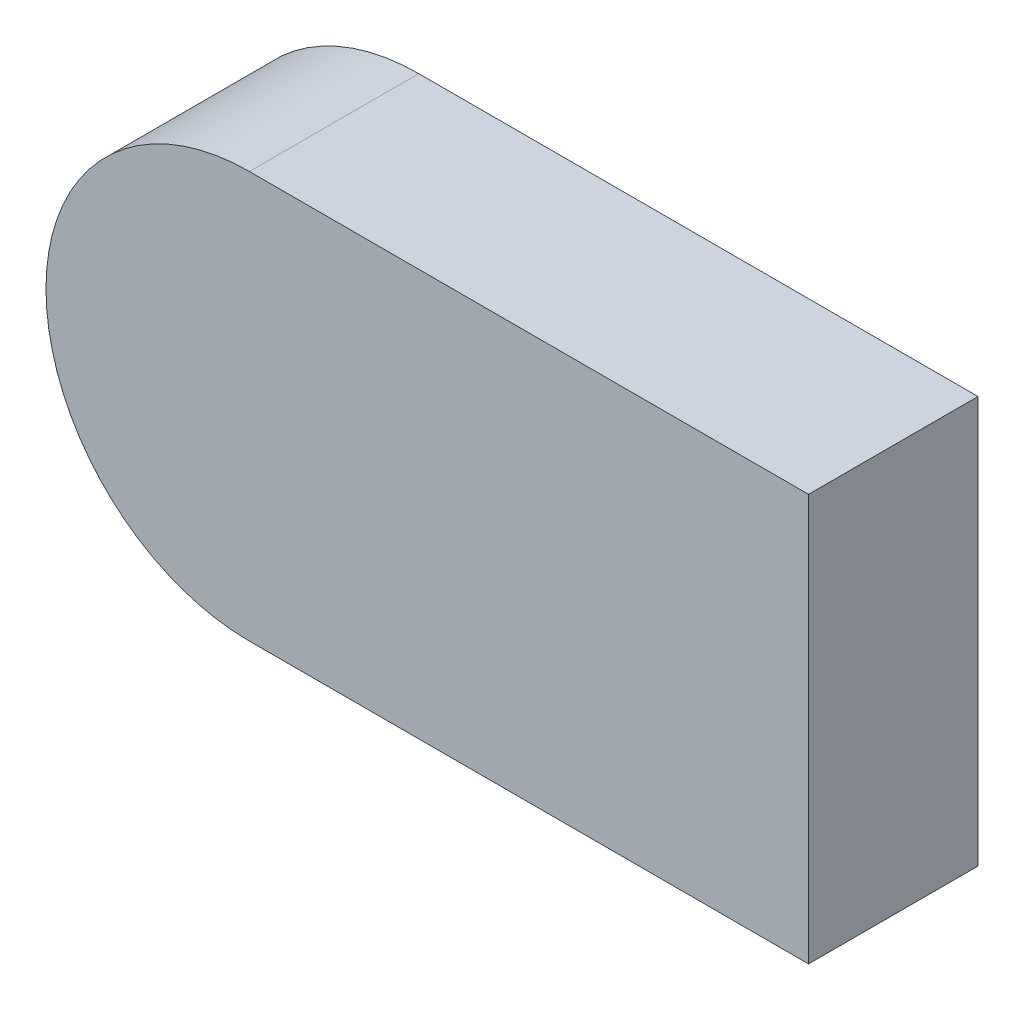
ISO-10303-21;
HEADER;
FILE_DESCRIPTION(('STEP AP214'),'2;1');
FILE_NAME('part.step','',(''),(''),'','','');
FILE_SCHEMA(('AUTOMOTIVE_DESIGN { 1 0 10303 214 1 1 1 1 }'));
ENDSEC;
DATA;
#1=APPLICATION_CONTEXT('core data for automotive mechanical design processes');
#2=APPLICATION_PROTOCOL_DEFINITION('international standard','automotive_design',2000,#1);
#3=PRODUCT_CONTEXT('',#1,'mechanical');
#4=PRODUCT('Part','Part','',(#3));
#5=PRODUCT_RELATED_PRODUCT_CATEGORY('part','',(#4));
#6=PRODUCT_DEFINITION_FORMATION('','',#4);
#7=PRODUCT_DEFINITION_CONTEXT('part definition',#1,'design');
#8=PRODUCT_DEFINITION('design','',#6,#7);
#9=PRODUCT_DEFINITION_SHAPE('','',#8);
#10=(LENGTH_UNIT() NAMED_UNIT(*) SI_UNIT(.MILLI.,.METRE.));
#11=(NAMED_UNIT(*) PLANE_ANGLE_UNIT() SI_UNIT($,.RADIAN.));
#12=(NAMED_UNIT(*) SI_UNIT($,.STERADIAN.) SOLID_ANGLE_UNIT());
#13=UNCERTAINTY_MEASURE_WITH_UNIT(LENGTH_MEASURE(1.E-05),#10,'distance_accuracy_value','');
#14=(GEOMETRIC_REPRESENTATION_CONTEXT(3) GLOBAL_UNCERTAINTY_ASSIGNED_CONTEXT((#13)) GLOBAL_UNIT_ASSIGNED_CONTEXT((#10,
#11,#12)) REPRESENTATION_CONTEXT('',''));
#15=CARTESIAN_POINT('',(0.,0.,0.));
#16=DIRECTION('',(0.,0.,1.));
#17=DIRECTION('',(1.,0.,0.));
#18=AXIS2_PLACEMENT_3D('',#15,#16,#17);
#19=CARTESIAN_POINT('',(4.05,-1.87,0.));
#20=DIRECTION('',(0.,-1.,0.));
#21=DIRECTION('',(-1.,0.,0.));
#22=AXIS2_PLACEMENT_3D('',#19,#20,#21);
#23=PLANE('',#22);
#24=DIRECTION('',(0.,0.,1.));
#25=VECTOR('',#24,1.);
#26=CARTESIAN_POINT('',(4.05,-1.87,0.));
#27=LINE('',#26,#25);
#28=CARTESIAN_POINT('',(4.05,-1.87,0.));
#29=VERTEX_POINT('',#28);
#30=CARTESIAN_POINT('',(4.05,-1.87,0.1));
#31=VERTEX_POINT('',#30);
#32=EDGE_CURVE('E11',#29,#31,#27,.T.);
#33=ORIENTED_EDGE('',*,*,#32,.T.);
#34=DIRECTION('',(-1.,0.,0.));
#35=VECTOR('',#34,1.);
#36=CARTESIAN_POINT('',(4.05,-1.87,0.1));
#37=LINE('',#36,#35);
#38=CARTESIAN_POINT('',(3.72,-1.87,0.1));
#39=VERTEX_POINT('',#38);
#40=EDGE_CURVE('E24',#31,#39,#37,.T.);
#41=ORIENTED_EDGE('',*,*,#40,.T.);
#42=DIRECTION('',(0.,0.,1.));
#43=VECTOR('',#42,1.);
#44=CARTESIAN_POINT('',(3.72,-1.87,0.));
#45=LINE('',#44,#43);
#46=CARTESIAN_POINT('',(3.72,-1.87,0.));
#47=VERTEX_POINT('',#46);
#48=EDGE_CURVE('E86',#47,#39,#45,.T.);
#49=ORIENTED_EDGE('',*,*,#48,.F.);
#50=DIRECTION('',(-1.,0.,0.));
#51=VECTOR('',#50,1.);
#52=CARTESIAN_POINT('',(4.05,-1.87,0.));
#53=LINE('',#52,#51);
#54=EDGE_CURVE('E83',#29,#47,#53,.T.);
#55=ORIENTED_EDGE('',*,*,#54,.F.);
#56=EDGE_LOOP('',(#33,#41,#49,#55));
#57=FACE_BOUND('',#56,.T.);
#58=ADVANCED_FACE('F17',(#57),#23,.T.);
#59=CARTESIAN_POINT('',(3.72,-1.75,0.));
#60=DIRECTION('',(0.,0.,-1.));
#61=DIRECTION('',(1.,0.,0.));
#62=AXIS2_PLACEMENT_3D('',#59,#60,#61);
#63=CYLINDRICAL_SURFACE('',#62,0.12);
#64=CARTESIAN_POINT('',(3.72,-1.75,0.));
#65=DIRECTION('',(0.,0.,1.));
#66=DIRECTION('',(1.,0.,0.));
#67=AXIS2_PLACEMENT_3D('',#64,#65,#66);
#68=CIRCLE('',#67,0.12);
#69=CARTESIAN_POINT('',(3.72,-1.63,0.));
#70=VERTEX_POINT('',#69);
#71=EDGE_CURVE('E80',#70,#47,#68,.T.);
#72=ORIENTED_EDGE('',*,*,#71,.T.);
#73=ORIENTED_EDGE('',*,*,#48,.T.);
#74=CARTESIAN_POINT('',(3.72,-1.75,0.1));
#75=DIRECTION('',(0.,0.,1.));
#76=DIRECTION('',(1.,0.,0.));
#77=AXIS2_PLACEMENT_3D('',#74,#75,#76);
#78=CIRCLE('',#77,0.12);
#79=CARTESIAN_POINT('',(3.72,-1.63,0.1));
#80=VERTEX_POINT('',#79);
#81=EDGE_CURVE('E78',#80,#39,#78,.T.);
#82=ORIENTED_EDGE('',*,*,#81,.F.);
#83=DIRECTION('',(0.,0.,1.));
#84=VECTOR('',#83,1.);
#85=CARTESIAN_POINT('',(3.72,-1.63,0.));
#86=LINE('',#85,#84);
#87=EDGE_CURVE('E67',#70,#80,#86,.T.);
#88=ORIENTED_EDGE('',*,*,#87,.F.);
#89=EDGE_LOOP('',(#72,#73,#82,#88));
#90=FACE_BOUND('',#89,.T.);
#91=ADVANCED_FACE('F89',(#90),#63,.T.);
#92=CARTESIAN_POINT('',(4.05,-1.63,0.));
#93=DIRECTION('',(0.,-1.,0.));
#94=DIRECTION('',(-1.,0.,0.));
#95=AXIS2_PLACEMENT_3D('',#92,#93,#94);
#96=PLANE('',#95);
#97=DIRECTION('',(-1.,0.,0.));
#98=VECTOR('',#97,1.);
#99=CARTESIAN_POINT('',(4.05,-1.63,0.));
#100=LINE('',#99,#98);
#101=CARTESIAN_POINT('',(4.05,-1.63,0.));
#102=VERTEX_POINT('',#101);
#103=EDGE_CURVE('E70',#102,#70,#100,.T.);
#104=ORIENTED_EDGE('',*,*,#103,.T.);
#105=ORIENTED_EDGE('',*,*,#87,.T.);
#106=DIRECTION('',(-1.,0.,0.));
#107=VECTOR('',#106,1.);
#108=CARTESIAN_POINT('',(4.05,-1.63,0.1));
#109=LINE('',#108,#107);
#110=CARTESIAN_POINT('',(4.05,-1.63,0.1));
#111=VERTEX_POINT('',#110);
#112=EDGE_CURVE('E61',#111,#80,#109,.T.);
#113=ORIENTED_EDGE('',*,*,#112,.F.);
#114=DIRECTION('',(0.,0.,1.));
#115=VECTOR('',#114,1.);
#116=CARTESIAN_POINT('',(4.05,-1.63,0.));
#117=LINE('',#116,#115);
#118=EDGE_CURVE('E51',#102,#111,#117,.T.);
#119=ORIENTED_EDGE('',*,*,#118,.F.);
#120=EDGE_LOOP('',(#104,#105,#113,#119));
#121=FACE_BOUND('',#120,.T.);
#122=ADVANCED_FACE('F65',(#121),#96,.F.);
#123=CARTESIAN_POINT('',(4.05,-1.87,0.));
#124=DIRECTION('',(-1.,0.,0.));
#125=DIRECTION('',(0.,1.,0.));
#126=AXIS2_PLACEMENT_3D('',#123,#124,#125);
#127=PLANE('',#126);
#128=DIRECTION('',(0.,1.,0.));
#129=VECTOR('',#128,1.);
#130=CARTESIAN_POINT('',(4.05,-1.87,0.));
#131=LINE('',#130,#129);
#132=EDGE_CURVE('E57',#29,#102,#131,.T.);
#133=ORIENTED_EDGE('',*,*,#132,.T.);
#134=ORIENTED_EDGE('',*,*,#118,.T.);
#135=DIRECTION('',(0.,1.,0.));
#136=VECTOR('',#135,1.);
#137=CARTESIAN_POINT('',(4.05,-1.87,0.1));
#138=LINE('',#137,#136);
#139=EDGE_CURVE('E55',#31,#111,#138,.T.);
#140=ORIENTED_EDGE('',*,*,#139,.F.);
#141=ORIENTED_EDGE('',*,*,#32,.F.);
#142=EDGE_LOOP('',(#133,#134,#140,#141));
#143=FACE_BOUND('',#142,.T.);
#144=ADVANCED_FACE('F53',(#143),#127,.F.);
#145=CARTESIAN_POINT('',(3.849490847913,-1.75,0.));
#146=DIRECTION('',(0.,0.,-1.));
#147=DIRECTION('',(-1.,0.,0.));
#148=AXIS2_PLACEMENT_3D('',#145,#146,#147);
#149=PLANE('',#148);
#150=ORIENTED_EDGE('',*,*,#54,.T.);
#151=ORIENTED_EDGE('',*,*,#71,.F.);
#152=ORIENTED_EDGE('',*,*,#103,.F.);
#153=ORIENTED_EDGE('',*,*,#132,.F.);
#154=EDGE_LOOP('',(#150,#151,#152,#153));
#155=FACE_BOUND('',#154,.T.);
#156=ADVANCED_FACE('F91',(#155),#149,.T.);
#157=CARTESIAN_POINT('',(3.849490847913,-1.75,0.1));
#158=DIRECTION('',(0.,0.,-1.));
#159=DIRECTION('',(-1.,0.,0.));
#160=AXIS2_PLACEMENT_3D('',#157,#158,#159);
#161=PLANE('',#160);
#162=ORIENTED_EDGE('',*,*,#139,.T.);
#163=ORIENTED_EDGE('',*,*,#112,.T.);
#164=ORIENTED_EDGE('',*,*,#81,.T.);
#165=ORIENTED_EDGE('',*,*,#40,.F.);
#166=EDGE_LOOP('',(#162,#163,#164,#165));
#167=FACE_BOUND('',#166,.T.);
#168=ADVANCED_FACE('F72',(#167),#161,.F.);
#169=CLOSED_SHELL('',(#58,#91,#122,#144,#156,#168));
#170=MANIFOLD_SOLID_BREP('B1',#169);
#171=ADVANCED_BREP_SHAPE_REPRESENTATION('',(#18,#170),#14);
#172=SHAPE_DEFINITION_REPRESENTATION(#9,#171);
ENDSEC;
END-ISO-10303-21;
